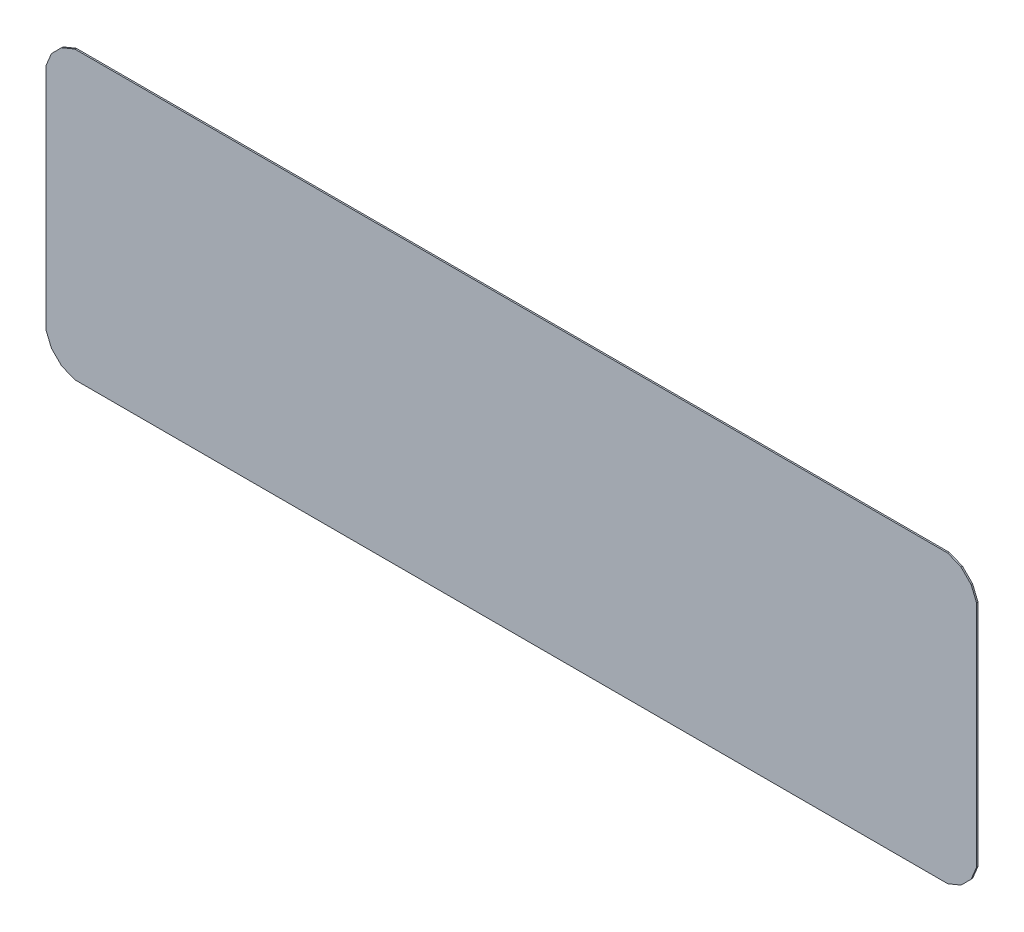
ISO-10303-21;
HEADER;
FILE_DESCRIPTION(('STEP AP214'),'2;1');
FILE_NAME('part.step','',(''),(''),'','','');
FILE_SCHEMA(('AUTOMOTIVE_DESIGN { 1 0 10303 214 1 1 1 1 }'));
ENDSEC;
DATA;
#1=APPLICATION_CONTEXT('core data for automotive mechanical design processes');
#2=APPLICATION_PROTOCOL_DEFINITION('international standard','automotive_design',2000,#1);
#3=PRODUCT_CONTEXT('',#1,'mechanical');
#4=PRODUCT('Part','Part','',(#3));
#5=PRODUCT_RELATED_PRODUCT_CATEGORY('part','',(#4));
#6=PRODUCT_DEFINITION_FORMATION('','',#4);
#7=PRODUCT_DEFINITION_CONTEXT('part definition',#1,'design');
#8=PRODUCT_DEFINITION('design','',#6,#7);
#9=PRODUCT_DEFINITION_SHAPE('','',#8);
#10=(LENGTH_UNIT() NAMED_UNIT(*) SI_UNIT(.MILLI.,.METRE.));
#11=(NAMED_UNIT(*) PLANE_ANGLE_UNIT() SI_UNIT($,.RADIAN.));
#12=(NAMED_UNIT(*) SI_UNIT($,.STERADIAN.) SOLID_ANGLE_UNIT());
#13=UNCERTAINTY_MEASURE_WITH_UNIT(LENGTH_MEASURE(1.E-05),#10,'distance_accuracy_value','');
#14=(GEOMETRIC_REPRESENTATION_CONTEXT(3) GLOBAL_UNCERTAINTY_ASSIGNED_CONTEXT((#13)) GLOBAL_UNIT_ASSIGNED_CONTEXT((#10,
#11,#12)) REPRESENTATION_CONTEXT('',''));
#15=CARTESIAN_POINT('',(0.,0.,0.));
#16=DIRECTION('',(0.,0.,1.));
#17=DIRECTION('',(1.,0.,0.));
#18=AXIS2_PLACEMENT_3D('',#15,#16,#17);
#19=CARTESIAN_POINT('',(-6.313356548066E-07,-2.060884616071E-07,0.0254));
#20=DIRECTION('',(0.,0.,1.));
#21=DIRECTION('',(1.,0.,0.));
#22=AXIS2_PLACEMENT_3D('',#19,#20,#21);
#23=PLANE('',#22);
#24=DIRECTION('',(-0.923881894534016,0.382677729888006,0.));
#25=VECTOR('',#24,1.);
#26=CARTESIAN_POINT('',(-7.97998658,-2.4437594,0.0254));
#27=LINE('',#26,#25);
#28=CARTESIAN_POINT('',(-7.97998658,-2.4437594,0.0254));
#29=VERTEX_POINT('',#28);
#30=CARTESIAN_POINT('',(-7.74641071999999,-2.54050799999997,0.0254));
#31=VERTEX_POINT('',#30);
#32=EDGE_CURVE('E133',#29,#31,#27,.F.);
#33=ORIENTED_EDGE('',*,*,#32,.T.);
#34=DIRECTION('',(1.,0.,0.));
#35=VECTOR('',#34,1.);
#36=CARTESIAN_POINT('',(-7.62,-2.540508,0.0254));
#37=LINE('',#36,#35);
#38=CARTESIAN_POINT('',(7.74640818,-2.540508,0.0254));
#39=VERTEX_POINT('',#38);
#40=EDGE_CURVE('E131',#31,#39,#37,.T.);
#41=ORIENTED_EDGE('',*,*,#40,.T.);
#42=DIRECTION('',(-0.923881894534016,-0.382677729888006,0.));
#43=VECTOR('',#42,1.);
#44=CARTESIAN_POINT('',(7.74640818,-2.540508,0.0254));
#45=LINE('',#44,#43);
#46=CARTESIAN_POINT('',(7.97998404000002,-2.44375940000003,0.0254));
#47=VERTEX_POINT('',#46);
#48=EDGE_CURVE('E128',#39,#47,#45,.F.);
#49=ORIENTED_EDGE('',*,*,#48,.T.);
#50=DIRECTION('',(-0.707106781186548,-0.707106781186548,0.));
#51=VECTOR('',#50,1.);
#52=CARTESIAN_POINT('',(7.97998404,-2.4437594,0.0254));
#53=LINE('',#52,#51);
#54=CARTESIAN_POINT('',(8.15875686,-2.26498658,0.0254));
#55=VERTEX_POINT('',#54);
#56=EDGE_CURVE('E219',#47,#55,#53,.F.);
#57=ORIENTED_EDGE('',*,*,#56,.T.);
#58=DIRECTION('',(-0.382686305252971,-0.92387834251693,0.));
#59=VECTOR('',#58,1.);
#60=CARTESIAN_POINT('',(8.15875686,-2.26498658,0.0254));
#61=LINE('',#60,#59);
#62=CARTESIAN_POINT('',(8.25550799999994,-2.03141071999997,0.0254));
#63=VERTEX_POINT('',#62);
#64=EDGE_CURVE('E213',#55,#63,#61,.F.);
#65=ORIENTED_EDGE('',*,*,#64,.T.);
#66=DIRECTION('',(0.,1.,0.));
#67=VECTOR('',#66,1.);
#68=CARTESIAN_POINT('',(8.255508,1.905,0.0254));
#69=LINE('',#68,#67);
#70=CARTESIAN_POINT('',(8.255508,2.03140818,0.0254));
#71=VERTEX_POINT('',#70);
#72=EDGE_CURVE('E208',#63,#71,#69,.T.);
#73=ORIENTED_EDGE('',*,*,#72,.T.);
#74=DIRECTION('',(0.382686305252971,-0.92387834251693,0.));
#75=VECTOR('',#74,1.);
#76=CARTESIAN_POINT('',(8.255508,2.03140818,0.0254));
#77=LINE('',#76,#75);
#78=CARTESIAN_POINT('',(8.15875686000007,2.26498404000003,0.0254));
#79=VERTEX_POINT('',#78);
#80=EDGE_CURVE('E203',#71,#79,#77,.F.);
#81=ORIENTED_EDGE('',*,*,#80,.T.);
#82=DIRECTION('',(0.707106781186548,-0.707106781186548,0.));
#83=VECTOR('',#82,1.);
#84=CARTESIAN_POINT('',(8.15875686,2.26498404,0.0254));
#85=LINE('',#84,#83);
#86=CARTESIAN_POINT('',(7.97998404,2.44375686,0.0254));
#87=VERTEX_POINT('',#86);
#88=EDGE_CURVE('E198',#79,#87,#85,.F.);
#89=ORIENTED_EDGE('',*,*,#88,.T.);
#90=DIRECTION('',(0.92387834251693,-0.382686305252971,0.));
#91=VECTOR('',#90,1.);
#92=CARTESIAN_POINT('',(7.97998404,2.44375686,0.0254));
#93=LINE('',#92,#91);
#94=CARTESIAN_POINT('',(7.74640817999997,2.54050799999994,0.0254));
#95=VERTEX_POINT('',#94);
#96=EDGE_CURVE('E192',#87,#95,#93,.F.);
#97=ORIENTED_EDGE('',*,*,#96,.T.);
#98=DIRECTION('',(1.,0.,0.));
#99=VECTOR('',#98,1.);
#100=CARTESIAN_POINT('',(-7.62,2.540508,0.0254));
#101=LINE('',#100,#99);
#102=CARTESIAN_POINT('',(-7.74641072,2.540508,0.0254));
#103=VERTEX_POINT('',#102);
#104=EDGE_CURVE('E187',#95,#103,#101,.F.);
#105=ORIENTED_EDGE('',*,*,#104,.T.);
#106=DIRECTION('',(0.92387834251693,0.382686305252971,0.));
#107=VECTOR('',#106,1.);
#108=CARTESIAN_POINT('',(-7.74641072,2.540508,0.0254));
#109=LINE('',#108,#107);
#110=CARTESIAN_POINT('',(-7.97998658000003,2.44375686000006,0.0254));
#111=VERTEX_POINT('',#110);
#112=EDGE_CURVE('E182',#103,#111,#109,.F.);
#113=ORIENTED_EDGE('',*,*,#112,.T.);
#114=DIRECTION('',(0.707106781186548,0.707106781186548,0.));
#115=VECTOR('',#114,1.);
#116=CARTESIAN_POINT('',(-7.97998658,2.44375686,0.0254));
#117=LINE('',#116,#115);
#118=CARTESIAN_POINT('',(-8.1587594,2.26498404,0.0254));
#119=VERTEX_POINT('',#118);
#120=EDGE_CURVE('E177',#111,#119,#117,.F.);
#121=ORIENTED_EDGE('',*,*,#120,.T.);
#122=DIRECTION('',(0.382677729888006,0.923881894534016,0.));
#123=VECTOR('',#122,1.);
#124=CARTESIAN_POINT('',(-8.1587594,2.26498404,0.0254));
#125=LINE('',#124,#123);
#126=CARTESIAN_POINT('',(-8.25550799999997,2.03140817999999,0.0254));
#127=VERTEX_POINT('',#126);
#128=EDGE_CURVE('E171',#119,#127,#125,.F.);
#129=ORIENTED_EDGE('',*,*,#128,.T.);
#130=DIRECTION('',(0.,1.,0.));
#131=VECTOR('',#130,1.);
#132=CARTESIAN_POINT('',(-8.255508,-1.905,0.0254));
#133=LINE('',#132,#131);
#134=CARTESIAN_POINT('',(-8.255508,-2.03141072,0.0254));
#135=VERTEX_POINT('',#134);
#136=EDGE_CURVE('E166',#127,#135,#133,.F.);
#137=ORIENTED_EDGE('',*,*,#136,.T.);
#138=DIRECTION('',(-0.382677729888006,0.923881894534016,0.));
#139=VECTOR('',#138,1.);
#140=CARTESIAN_POINT('',(-8.255508,-2.03141072,0.0254));
#141=LINE('',#140,#139);
#142=CARTESIAN_POINT('',(-8.15875940000003,-2.26498658000001,0.0254));
#143=VERTEX_POINT('',#142);
#144=EDGE_CURVE('E161',#135,#143,#141,.F.);
#145=ORIENTED_EDGE('',*,*,#144,.T.);
#146=DIRECTION('',(-0.707106781186548,0.707106781186548,0.));
#147=VECTOR('',#146,1.);
#148=CARTESIAN_POINT('',(-8.1587594,-2.26498658,0.0254));
#149=LINE('',#148,#147);
#150=EDGE_CURVE('E156',#143,#29,#149,.F.);
#151=ORIENTED_EDGE('',*,*,#150,.T.);
#152=EDGE_LOOP('',(#33,#41,#49,#57,#65,#73,#81,#89,#97,#105,#113,#121,#129,#137,#145,#151));
#153=FACE_BOUND('',#152,.T.);
#154=ADVANCED_FACE('F17',(#153),#23,.T.);
#155=CARTESIAN_POINT('',(7.74640818,-2.540508,0.));
#156=DIRECTION('',(-0.382677729888006,0.923881894534016,0.));
#157=DIRECTION('',(-0.923881894534016,-0.382677729888006,0.));
#158=AXIS2_PLACEMENT_3D('',#155,#156,#157);
#159=PLANE('',#158);
#160=DIRECTION('',(0.,0.,1.));
#161=VECTOR('',#160,1.);
#162=CARTESIAN_POINT('',(7.97998404,-2.4437594,0.));
#163=LINE('',#162,#161);
#164=CARTESIAN_POINT('',(7.97998404000002,-2.44375940000003,0.));
#165=VERTEX_POINT('',#164);
#166=EDGE_CURVE('E143',#165,#47,#163,.T.);
#167=ORIENTED_EDGE('',*,*,#166,.T.);
#168=ORIENTED_EDGE('',*,*,#48,.F.);
#169=DIRECTION('',(0.,0.,1.));
#170=VECTOR('',#169,1.);
#171=CARTESIAN_POINT('',(7.74640818,-2.540508,0.));
#172=LINE('',#171,#170);
#173=CARTESIAN_POINT('',(7.74640818,-2.540508,0.));
#174=VERTEX_POINT('',#173);
#175=EDGE_CURVE('E20',#174,#39,#172,.T.);
#176=ORIENTED_EDGE('',*,*,#175,.F.);
#177=DIRECTION('',(0.923881894533902,0.38267772988828,0.));
#178=VECTOR('',#177,1.);
#179=CARTESIAN_POINT('',(7.74640818,-2.540508,0.));
#180=LINE('',#179,#178);
#181=EDGE_CURVE('E145',#174,#165,#180,.T.);
#182=ORIENTED_EDGE('',*,*,#181,.T.);
#183=EDGE_LOOP('',(#167,#168,#176,#182));
#184=FACE_BOUND('',#183,.T.);
#185=ADVANCED_FACE('F141',(#184),#159,.F.);
#186=CARTESIAN_POINT('',(7.97998404,-2.4437594,0.));
#187=DIRECTION('',(-0.707106781186548,0.707106781186548,0.));
#188=DIRECTION('',(-0.707106781186548,-0.707106781186548,0.));
#189=AXIS2_PLACEMENT_3D('',#186,#187,#188);
#190=PLANE('',#189);
#191=DIRECTION('',(0.,0.,1.));
#192=VECTOR('',#191,1.);
#193=CARTESIAN_POINT('',(8.15875686,-2.26498658,0.));
#194=LINE('',#193,#192);
#195=CARTESIAN_POINT('',(8.15875686,-2.26498658,0.));
#196=VERTEX_POINT('',#195);
#197=EDGE_CURVE('E216',#196,#55,#194,.T.);
#198=ORIENTED_EDGE('',*,*,#197,.T.);
#199=ORIENTED_EDGE('',*,*,#56,.F.);
#200=ORIENTED_EDGE('',*,*,#166,.F.);
#201=DIRECTION('',(0.707106781186549,0.707106781186546,0.));
#202=VECTOR('',#201,1.);
#203=CARTESIAN_POINT('',(7.97998404,-2.4437594,0.));
#204=LINE('',#203,#202);
#205=EDGE_CURVE('E147',#165,#196,#204,.T.);
#206=ORIENTED_EDGE('',*,*,#205,.T.);
#207=EDGE_LOOP('',(#198,#199,#200,#206));
#208=FACE_BOUND('',#207,.T.);
#209=ADVANCED_FACE('F228',(#208),#190,.F.);
#210=CARTESIAN_POINT('',(8.15875686,-2.26498658,0.));
#211=DIRECTION('',(-0.92387834251693,0.382686305252971,0.));
#212=DIRECTION('',(-0.382686305252971,-0.92387834251693,0.));
#213=AXIS2_PLACEMENT_3D('',#210,#211,#212);
#214=PLANE('',#213);
#215=DIRECTION('',(0.,0.,1.));
#216=VECTOR('',#215,1.);
#217=CARTESIAN_POINT('',(8.255508,-2.03141072,0.));
#218=LINE('',#217,#216);
#219=CARTESIAN_POINT('',(8.25550799999994,-2.03141071999997,0.));
#220=VERTEX_POINT('',#219);
#221=EDGE_CURVE('E210',#220,#63,#218,.T.);
#222=ORIENTED_EDGE('',*,*,#221,.T.);
#223=ORIENTED_EDGE('',*,*,#64,.F.);
#224=ORIENTED_EDGE('',*,*,#197,.F.);
#225=DIRECTION('',(0.382686305253477,0.923878342516721,0.));
#226=VECTOR('',#225,1.);
#227=CARTESIAN_POINT('',(8.15875686,-2.26498658,0.));
#228=LINE('',#227,#226);
#229=EDGE_CURVE('E230',#196,#220,#228,.T.);
#230=ORIENTED_EDGE('',*,*,#229,.T.);
#231=EDGE_LOOP('',(#222,#223,#224,#230));
#232=FACE_BOUND('',#231,.T.);
#233=ADVANCED_FACE('F224',(#232),#214,.F.);
#234=CARTESIAN_POINT('',(8.255508,1.905,0.));
#235=DIRECTION('',(-1.,0.,0.));
#236=DIRECTION('',(0.,0.,1.));
#237=AXIS2_PLACEMENT_3D('',#234,#235,#236);
#238=PLANE('',#237);
#239=DIRECTION('',(0.,0.,1.));
#240=VECTOR('',#239,1.);
#241=CARTESIAN_POINT('',(8.255508,2.03140818,0.));
#242=LINE('',#241,#240);
#243=CARTESIAN_POINT('',(8.255508,2.03140818,0.));
#244=VERTEX_POINT('',#243);
#245=EDGE_CURVE('E205',#244,#71,#242,.T.);
#246=ORIENTED_EDGE('',*,*,#245,.T.);
#247=ORIENTED_EDGE('',*,*,#72,.F.);
#248=ORIENTED_EDGE('',*,*,#221,.F.);
#249=DIRECTION('',(0.,1.,0.));
#250=VECTOR('',#249,1.);
#251=CARTESIAN_POINT('',(8.255508,-2.060884616071E-07,0.));
#252=LINE('',#251,#250);
#253=EDGE_CURVE('E231',#220,#244,#252,.T.);
#254=ORIENTED_EDGE('',*,*,#253,.T.);
#255=EDGE_LOOP('',(#246,#247,#248,#254));
#256=FACE_BOUND('',#255,.T.);
#257=ADVANCED_FACE('F305',(#256),#238,.F.);
#258=CARTESIAN_POINT('',(8.255508,2.03140818,0.));
#259=DIRECTION('',(-0.92387834251693,-0.382686305252971,0.));
#260=DIRECTION('',(0.382686305252971,-0.92387834251693,0.));
#261=AXIS2_PLACEMENT_3D('',#258,#259,#260);
#262=PLANE('',#261);
#263=DIRECTION('',(0.,0.,1.));
#264=VECTOR('',#263,1.);
#265=CARTESIAN_POINT('',(8.15875686,2.26498404,0.));
#266=LINE('',#265,#264);
#267=CARTESIAN_POINT('',(8.15875686000007,2.26498404000003,0.));
#268=VERTEX_POINT('',#267);
#269=EDGE_CURVE('E200',#268,#79,#266,.T.);
#270=ORIENTED_EDGE('',*,*,#269,.T.);
#271=ORIENTED_EDGE('',*,*,#80,.F.);
#272=ORIENTED_EDGE('',*,*,#245,.F.);
#273=DIRECTION('',(-0.382686305253477,0.92387834251672,0.));
#274=VECTOR('',#273,1.);
#275=CARTESIAN_POINT('',(8.255508,2.03140818,0.));
#276=LINE('',#275,#274);
#277=EDGE_CURVE('E235',#244,#268,#276,.T.);
#278=ORIENTED_EDGE('',*,*,#277,.T.);
#279=EDGE_LOOP('',(#270,#271,#272,#278));
#280=FACE_BOUND('',#279,.T.);
#281=ADVANCED_FACE('F302',(#280),#262,.F.);
#282=CARTESIAN_POINT('',(8.15875686,2.26498404,0.));
#283=DIRECTION('',(-0.707106781186548,-0.707106781186548,0.));
#284=DIRECTION('',(0.707106781186548,-0.707106781186548,0.));
#285=AXIS2_PLACEMENT_3D('',#282,#283,#284);
#286=PLANE('',#285);
#287=DIRECTION('',(0.,0.,1.));
#288=VECTOR('',#287,1.);
#289=CARTESIAN_POINT('',(7.97998404,2.44375686,0.));
#290=LINE('',#289,#288);
#291=CARTESIAN_POINT('',(7.97998404,2.44375686,0.));
#292=VERTEX_POINT('',#291);
#293=EDGE_CURVE('E195',#292,#87,#290,.T.);
#294=ORIENTED_EDGE('',*,*,#293,.T.);
#295=ORIENTED_EDGE('',*,*,#88,.F.);
#296=ORIENTED_EDGE('',*,*,#269,.F.);
#297=DIRECTION('',(-0.707106781186549,0.707106781186546,0.));
#298=VECTOR('',#297,1.);
#299=CARTESIAN_POINT('',(8.15875686,2.26498404,0.));
#300=LINE('',#299,#298);
#301=EDGE_CURVE('E238',#268,#292,#300,.T.);
#302=ORIENTED_EDGE('',*,*,#301,.T.);
#303=EDGE_LOOP('',(#294,#295,#296,#302));
#304=FACE_BOUND('',#303,.T.);
#305=ADVANCED_FACE('F297',(#304),#286,.F.);
#306=CARTESIAN_POINT('',(7.97998404,2.44375686,0.));
#307=DIRECTION('',(-0.382686305252971,-0.92387834251693,0.));
#308=DIRECTION('',(0.92387834251693,-0.382686305252971,0.));
#309=AXIS2_PLACEMENT_3D('',#306,#307,#308);
#310=PLANE('',#309);
#311=DIRECTION('',(0.,0.,-1.));
#312=VECTOR('',#311,1.);
#313=CARTESIAN_POINT('',(7.74640818,2.540508,0.));
#314=LINE('',#313,#312);
#315=CARTESIAN_POINT('',(7.74640817999997,2.54050799999994,0.));
#316=VERTEX_POINT('',#315);
#317=EDGE_CURVE('E189',#316,#95,#314,.F.);
#318=ORIENTED_EDGE('',*,*,#317,.T.);
#319=ORIENTED_EDGE('',*,*,#96,.F.);
#320=ORIENTED_EDGE('',*,*,#293,.F.);
#321=DIRECTION('',(-0.923878342516721,0.382686305253476,0.));
#322=VECTOR('',#321,1.);
#323=CARTESIAN_POINT('',(7.97998404,2.44375686,0.));
#324=LINE('',#323,#322);
#325=EDGE_CURVE('E241',#292,#316,#324,.T.);
#326=ORIENTED_EDGE('',*,*,#325,.T.);
#327=EDGE_LOOP('',(#318,#319,#320,#326));
#328=FACE_BOUND('',#327,.T.);
#329=ADVANCED_FACE('F293',(#328),#310,.F.);
#330=CARTESIAN_POINT('',(-7.62,2.540508,0.));
#331=DIRECTION('',(0.,-1.,0.));
#332=DIRECTION('',(0.,0.,-1.));
#333=AXIS2_PLACEMENT_3D('',#330,#331,#332);
#334=PLANE('',#333);
#335=DIRECTION('',(0.,0.,1.));
#336=VECTOR('',#335,1.);
#337=CARTESIAN_POINT('',(-7.74641072,2.540508,0.));
#338=LINE('',#337,#336);
#339=CARTESIAN_POINT('',(-7.74641072,2.540508,0.));
#340=VERTEX_POINT('',#339);
#341=EDGE_CURVE('E184',#340,#103,#338,.T.);
#342=ORIENTED_EDGE('',*,*,#341,.T.);
#343=ORIENTED_EDGE('',*,*,#104,.F.);
#344=ORIENTED_EDGE('',*,*,#317,.F.);
#345=DIRECTION('',(1.,0.,0.));
#346=VECTOR('',#345,1.);
#347=CARTESIAN_POINT('',(-6.313356548066E-07,2.540508,0.));
#348=LINE('',#347,#346);
#349=EDGE_CURVE('E244',#316,#340,#348,.F.);
#350=ORIENTED_EDGE('',*,*,#349,.T.);
#351=EDGE_LOOP('',(#342,#343,#344,#350));
#352=FACE_BOUND('',#351,.T.);
#353=ADVANCED_FACE('F289',(#352),#334,.F.);
#354=CARTESIAN_POINT('',(-7.74641072,2.540508,0.));
#355=DIRECTION('',(0.382686305252971,-0.92387834251693,0.));
#356=DIRECTION('',(0.92387834251693,0.382686305252971,0.));
#357=AXIS2_PLACEMENT_3D('',#354,#355,#356);
#358=PLANE('',#357);
#359=DIRECTION('',(0.,0.,1.));
#360=VECTOR('',#359,1.);
#361=CARTESIAN_POINT('',(-7.97998658,2.44375686,0.));
#362=LINE('',#361,#360);
#363=CARTESIAN_POINT('',(-7.97998658000003,2.44375686000006,0.));
#364=VERTEX_POINT('',#363);
#365=EDGE_CURVE('E179',#364,#111,#362,.T.);
#366=ORIENTED_EDGE('',*,*,#365,.T.);
#367=ORIENTED_EDGE('',*,*,#112,.F.);
#368=ORIENTED_EDGE('',*,*,#341,.F.);
#369=DIRECTION('',(-0.923878342516721,-0.382686305253475,0.));
#370=VECTOR('',#369,1.);
#371=CARTESIAN_POINT('',(-7.74641072,2.540508,0.));
#372=LINE('',#371,#370);
#373=EDGE_CURVE('E246',#340,#364,#372,.T.);
#374=ORIENTED_EDGE('',*,*,#373,.T.);
#375=EDGE_LOOP('',(#366,#367,#368,#374));
#376=FACE_BOUND('',#375,.T.);
#377=ADVANCED_FACE('F286',(#376),#358,.F.);
#378=CARTESIAN_POINT('',(-7.97998658,2.44375686,0.));
#379=DIRECTION('',(0.707106781186548,-0.707106781186548,0.));
#380=DIRECTION('',(0.707106781186548,0.707106781186548,0.));
#381=AXIS2_PLACEMENT_3D('',#378,#379,#380);
#382=PLANE('',#381);
#383=DIRECTION('',(0.,0.,1.));
#384=VECTOR('',#383,1.);
#385=CARTESIAN_POINT('',(-8.1587594,2.26498404,0.));
#386=LINE('',#385,#384);
#387=CARTESIAN_POINT('',(-8.1587594,2.26498404,0.));
#388=VERTEX_POINT('',#387);
#389=EDGE_CURVE('E174',#388,#119,#386,.T.);
#390=ORIENTED_EDGE('',*,*,#389,.T.);
#391=ORIENTED_EDGE('',*,*,#120,.F.);
#392=ORIENTED_EDGE('',*,*,#365,.F.);
#393=DIRECTION('',(-0.707106781186546,-0.707106781186549,0.));
#394=VECTOR('',#393,1.);
#395=CARTESIAN_POINT('',(-7.97998658,2.44375686,0.));
#396=LINE('',#395,#394);
#397=EDGE_CURVE('E249',#364,#388,#396,.T.);
#398=ORIENTED_EDGE('',*,*,#397,.T.);
#399=EDGE_LOOP('',(#390,#391,#392,#398));
#400=FACE_BOUND('',#399,.T.);
#401=ADVANCED_FACE('F281',(#400),#382,.F.);
#402=CARTESIAN_POINT('',(-8.1587594,2.26498404,0.));
#403=DIRECTION('',(0.923881894534016,-0.382677729888006,0.));
#404=DIRECTION('',(0.382677729888006,0.923881894534016,0.));
#405=AXIS2_PLACEMENT_3D('',#402,#403,#404);
#406=PLANE('',#405);
#407=DIRECTION('',(0.,0.,-1.));
#408=VECTOR('',#407,1.);
#409=CARTESIAN_POINT('',(-8.255508,2.03140818,0.));
#410=LINE('',#409,#408);
#411=CARTESIAN_POINT('',(-8.25550799999997,2.03140817999999,0.));
#412=VERTEX_POINT('',#411);
#413=EDGE_CURVE('E168',#412,#127,#410,.F.);
#414=ORIENTED_EDGE('',*,*,#413,.T.);
#415=ORIENTED_EDGE('',*,*,#128,.F.);
#416=ORIENTED_EDGE('',*,*,#389,.F.);
#417=DIRECTION('',(-0.382677729888286,-0.9238818945339,0.));
#418=VECTOR('',#417,1.);
#419=CARTESIAN_POINT('',(-8.1587594,2.26498404,0.));
#420=LINE('',#419,#418);
#421=EDGE_CURVE('E252',#388,#412,#420,.T.);
#422=ORIENTED_EDGE('',*,*,#421,.T.);
#423=EDGE_LOOP('',(#414,#415,#416,#422));
#424=FACE_BOUND('',#423,.T.);
#425=ADVANCED_FACE('F277',(#424),#406,.F.);
#426=CARTESIAN_POINT('',(-8.255508,-1.905,0.));
#427=DIRECTION('',(1.,0.,0.));
#428=DIRECTION('',(0.,0.,-1.));
#429=AXIS2_PLACEMENT_3D('',#426,#427,#428);
#430=PLANE('',#429);
#431=DIRECTION('',(0.,0.,1.));
#432=VECTOR('',#431,1.);
#433=CARTESIAN_POINT('',(-8.255508,-2.03141072,0.));
#434=LINE('',#433,#432);
#435=CARTESIAN_POINT('',(-8.255508,-2.03141072,0.));
#436=VERTEX_POINT('',#435);
#437=EDGE_CURVE('E163',#436,#135,#434,.T.);
#438=ORIENTED_EDGE('',*,*,#437,.T.);
#439=ORIENTED_EDGE('',*,*,#136,.F.);
#440=ORIENTED_EDGE('',*,*,#413,.F.);
#441=DIRECTION('',(0.,1.,0.));
#442=VECTOR('',#441,1.);
#443=CARTESIAN_POINT('',(-8.255508,-2.060884616071E-07,0.));
#444=LINE('',#443,#442);
#445=EDGE_CURVE('E255',#412,#436,#444,.F.);
#446=ORIENTED_EDGE('',*,*,#445,.T.);
#447=EDGE_LOOP('',(#438,#439,#440,#446));
#448=FACE_BOUND('',#447,.T.);
#449=ADVANCED_FACE('F273',(#448),#430,.F.);
#450=CARTESIAN_POINT('',(-8.255508,-2.03141072,0.));
#451=DIRECTION('',(0.923881894534016,0.382677729888006,0.));
#452=DIRECTION('',(-0.382677729888006,0.923881894534016,0.));
#453=AXIS2_PLACEMENT_3D('',#450,#451,#452);
#454=PLANE('',#453);
#455=DIRECTION('',(0.,0.,1.));
#456=VECTOR('',#455,1.);
#457=CARTESIAN_POINT('',(-8.1587594,-2.26498658,0.));
#458=LINE('',#457,#456);
#459=CARTESIAN_POINT('',(-8.15875940000003,-2.26498658000001,0.));
#460=VERTEX_POINT('',#459);
#461=EDGE_CURVE('E158',#460,#143,#458,.T.);
#462=ORIENTED_EDGE('',*,*,#461,.T.);
#463=ORIENTED_EDGE('',*,*,#144,.F.);
#464=ORIENTED_EDGE('',*,*,#437,.F.);
#465=DIRECTION('',(0.382677729888286,-0.9238818945339,0.));
#466=VECTOR('',#465,1.);
#467=CARTESIAN_POINT('',(-8.255508,-2.03141072,0.));
#468=LINE('',#467,#466);
#469=EDGE_CURVE('E257',#436,#460,#468,.T.);
#470=ORIENTED_EDGE('',*,*,#469,.T.);
#471=EDGE_LOOP('',(#462,#463,#464,#470));
#472=FACE_BOUND('',#471,.T.);
#473=ADVANCED_FACE('F270',(#472),#454,.F.);
#474=CARTESIAN_POINT('',(-8.1587594,-2.26498658,0.));
#475=DIRECTION('',(0.707106781186548,0.707106781186548,0.));
#476=DIRECTION('',(-0.707106781186548,0.707106781186548,0.));
#477=AXIS2_PLACEMENT_3D('',#474,#475,#476);
#478=PLANE('',#477);
#479=DIRECTION('',(0.,0.,1.));
#480=VECTOR('',#479,1.);
#481=CARTESIAN_POINT('',(-7.97998658,-2.4437594,0.));
#482=LINE('',#481,#480);
#483=CARTESIAN_POINT('',(-7.97998658,-2.4437594,0.));
#484=VERTEX_POINT('',#483);
#485=EDGE_CURVE('E153',#484,#29,#482,.T.);
#486=ORIENTED_EDGE('',*,*,#485,.T.);
#487=ORIENTED_EDGE('',*,*,#150,.F.);
#488=ORIENTED_EDGE('',*,*,#461,.F.);
#489=DIRECTION('',(0.707106781186546,-0.707106781186549,0.));
#490=VECTOR('',#489,1.);
#491=CARTESIAN_POINT('',(-8.1587594,-2.26498658,0.));
#492=LINE('',#491,#490);
#493=EDGE_CURVE('E26',#460,#484,#492,.T.);
#494=ORIENTED_EDGE('',*,*,#493,.T.);
#495=EDGE_LOOP('',(#486,#487,#488,#494));
#496=FACE_BOUND('',#495,.T.);
#497=ADVANCED_FACE('F263',(#496),#478,.F.);
#498=CARTESIAN_POINT('',(-7.97998658,-2.4437594,0.));
#499=DIRECTION('',(0.382677729888006,0.923881894534016,0.));
#500=DIRECTION('',(-0.923881894534016,0.382677729888006,0.));
#501=AXIS2_PLACEMENT_3D('',#498,#499,#500);
#502=PLANE('',#501);
#503=DIRECTION('',(0.,0.,1.));
#504=VECTOR('',#503,1.);
#505=CARTESIAN_POINT('',(-7.74641072,-2.540508,0.));
#506=LINE('',#505,#504);
#507=CARTESIAN_POINT('',(-7.74641071999999,-2.54050799999997,0.));
#508=VERTEX_POINT('',#507);
#509=EDGE_CURVE('E137',#508,#31,#506,.T.);
#510=ORIENTED_EDGE('',*,*,#509,.T.);
#511=ORIENTED_EDGE('',*,*,#32,.F.);
#512=ORIENTED_EDGE('',*,*,#485,.F.);
#513=DIRECTION('',(0.923881894533903,-0.382677729888279,0.));
#514=VECTOR('',#513,1.);
#515=CARTESIAN_POINT('',(-7.97998658,-2.4437594,0.));
#516=LINE('',#515,#514);
#517=EDGE_CURVE('E11',#484,#508,#516,.T.);
#518=ORIENTED_EDGE('',*,*,#517,.T.);
#519=EDGE_LOOP('',(#510,#511,#512,#518));
#520=FACE_BOUND('',#519,.T.);
#521=ADVANCED_FACE('F307',(#520),#502,.F.);
#522=CARTESIAN_POINT('',(-7.62,-2.540508,0.));
#523=DIRECTION('',(0.,1.,0.));
#524=DIRECTION('',(0.,0.,1.));
#525=AXIS2_PLACEMENT_3D('',#522,#523,#524);
#526=PLANE('',#525);
#527=ORIENTED_EDGE('',*,*,#509,.F.);
#528=DIRECTION('',(1.,0.,0.));
#529=VECTOR('',#528,1.);
#530=CARTESIAN_POINT('',(-6.313356548066E-07,-2.540508,0.));
#531=LINE('',#530,#529);
#532=EDGE_CURVE('E35',#508,#174,#531,.T.);
#533=ORIENTED_EDGE('',*,*,#532,.T.);
#534=ORIENTED_EDGE('',*,*,#175,.T.);
#535=ORIENTED_EDGE('',*,*,#40,.F.);
#536=EDGE_LOOP('',(#527,#533,#534,#535));
#537=FACE_BOUND('',#536,.T.);
#538=ADVANCED_FACE('F144',(#537),#526,.F.);
#539=CARTESIAN_POINT('',(-6.313356548066E-07,-2.060884616071E-07,0.));
#540=DIRECTION('',(0.,0.,1.));
#541=DIRECTION('',(1.,0.,0.));
#542=AXIS2_PLACEMENT_3D('',#539,#540,#541);
#543=PLANE('',#542);
#544=ORIENTED_EDGE('',*,*,#532,.F.);
#545=ORIENTED_EDGE('',*,*,#517,.F.);
#546=ORIENTED_EDGE('',*,*,#493,.F.);
#547=ORIENTED_EDGE('',*,*,#469,.F.);
#548=ORIENTED_EDGE('',*,*,#445,.F.);
#549=ORIENTED_EDGE('',*,*,#421,.F.);
#550=ORIENTED_EDGE('',*,*,#397,.F.);
#551=ORIENTED_EDGE('',*,*,#373,.F.);
#552=ORIENTED_EDGE('',*,*,#349,.F.);
#553=ORIENTED_EDGE('',*,*,#325,.F.);
#554=ORIENTED_EDGE('',*,*,#301,.F.);
#555=ORIENTED_EDGE('',*,*,#277,.F.);
#556=ORIENTED_EDGE('',*,*,#253,.F.);
#557=ORIENTED_EDGE('',*,*,#229,.F.);
#558=ORIENTED_EDGE('',*,*,#205,.F.);
#559=ORIENTED_EDGE('',*,*,#181,.F.);
#560=EDGE_LOOP('',(#544,#545,#546,#547,#548,#549,#550,#551,#552,#553,#554,#555,#556,#557,#558,#559));
#561=FACE_BOUND('',#560,.T.);
#562=ADVANCED_FACE('F266',(#561),#543,.F.);
#563=CLOSED_SHELL('',(#154,#185,#209,#233,#257,#281,#305,#329,#353,#377,#401,#425,#449,#473,
#497,#521,#538,#562));
#564=MANIFOLD_SOLID_BREP('B1',#563);
#565=ADVANCED_BREP_SHAPE_REPRESENTATION('',(#18,#564),#14);
#566=SHAPE_DEFINITION_REPRESENTATION(#9,#565);
ENDSEC;
END-ISO-10303-21;
